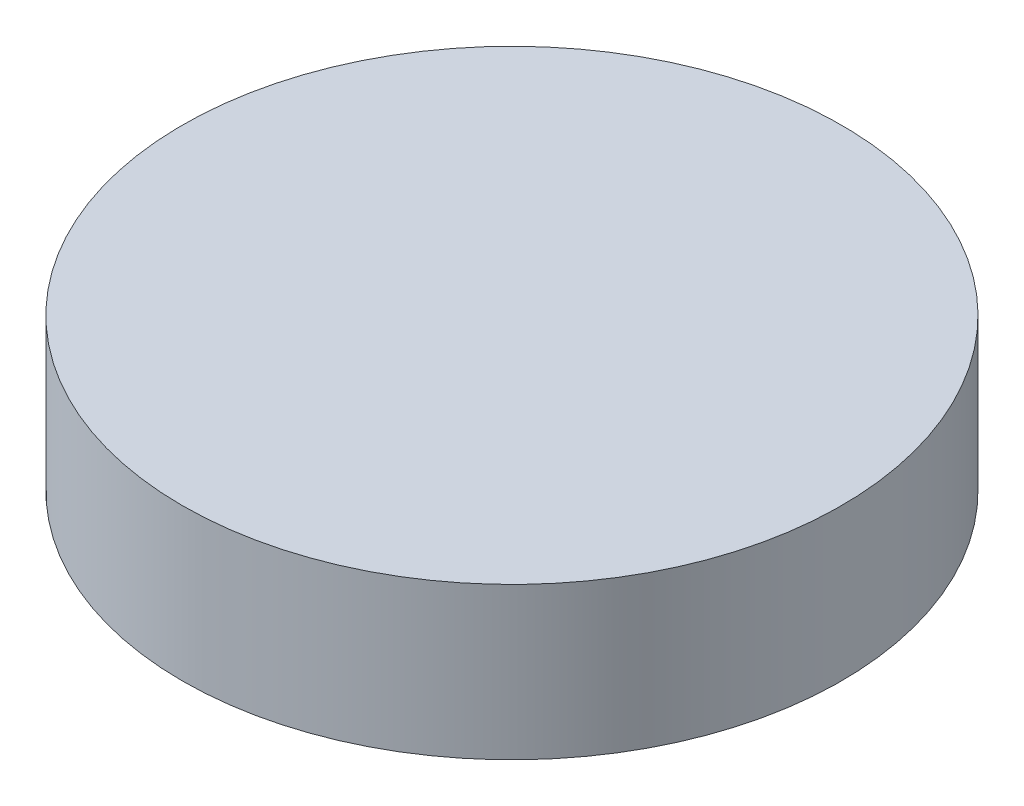
ISO-10303-21;
HEADER;
FILE_DESCRIPTION(('STEP AP214'),'2;1');
FILE_NAME('part.step','',(''),(''),'','','');
FILE_SCHEMA(('AUTOMOTIVE_DESIGN { 1 0 10303 214 1 1 1 1 }'));
ENDSEC;
DATA;
#1=APPLICATION_CONTEXT('core data for automotive mechanical design processes');
#2=APPLICATION_PROTOCOL_DEFINITION('international standard','automotive_design',2000,#1);
#3=PRODUCT_CONTEXT('',#1,'mechanical');
#4=PRODUCT('Part','Part','',(#3));
#5=PRODUCT_RELATED_PRODUCT_CATEGORY('part','',(#4));
#6=PRODUCT_DEFINITION_FORMATION('','',#4);
#7=PRODUCT_DEFINITION_CONTEXT('part definition',#1,'design');
#8=PRODUCT_DEFINITION('design','',#6,#7);
#9=PRODUCT_DEFINITION_SHAPE('','',#8);
#10=(LENGTH_UNIT() NAMED_UNIT(*) SI_UNIT(.MILLI.,.METRE.));
#11=(NAMED_UNIT(*) PLANE_ANGLE_UNIT() SI_UNIT($,.RADIAN.));
#12=(NAMED_UNIT(*) SI_UNIT($,.STERADIAN.) SOLID_ANGLE_UNIT());
#13=UNCERTAINTY_MEASURE_WITH_UNIT(LENGTH_MEASURE(1.E-05),#10,'distance_accuracy_value','');
#14=(GEOMETRIC_REPRESENTATION_CONTEXT(3) GLOBAL_UNCERTAINTY_ASSIGNED_CONTEXT((#13)) GLOBAL_UNIT_ASSIGNED_CONTEXT((#10,
#11,#12)) REPRESENTATION_CONTEXT('',''));
#15=CARTESIAN_POINT('',(0.,0.,0.));
#16=DIRECTION('',(0.,0.,1.));
#17=DIRECTION('',(1.,0.,0.));
#18=AXIS2_PLACEMENT_3D('',#15,#16,#17);
#19=CARTESIAN_POINT('',(-27.5,34.6557828482519,-11.5));
#20=DIRECTION('',(0.,1.,0.));
#21=DIRECTION('',(0.,0.,1.));
#22=AXIS2_PLACEMENT_3D('',#19,#20,#21);
#23=CYLINDRICAL_SURFACE('',#22,5.425);
#24=CARTESIAN_POINT('',(-27.5,50.5,-11.5));
#25=DIRECTION('',(0.,1.,0.));
#26=DIRECTION('',(0.,0.,1.));
#27=AXIS2_PLACEMENT_3D('',#24,#25,#26);
#28=CIRCLE('',#27,5.425);
#29=CARTESIAN_POINT('',(-27.5,50.5,-6.07499999999999));
#30=VERTEX_POINT('',#29);
#31=EDGE_CURVE('E11',#30,#30,#28,.F.);
#32=ORIENTED_EDGE('',*,*,#31,.F.);
#33=EDGE_LOOP('',(#32));
#34=FACE_BOUND('',#33,.T.);
#35=CARTESIAN_POINT('',(-27.5,53.,-11.5));
#36=DIRECTION('',(0.,1.,0.));
#37=DIRECTION('',(0.,0.,1.));
#38=AXIS2_PLACEMENT_3D('',#35,#36,#37);
#39=CIRCLE('',#38,5.425);
#40=CARTESIAN_POINT('',(-27.5,53.,-6.07499999999999));
#41=VERTEX_POINT('',#40);
#42=EDGE_CURVE('E43',#41,#41,#39,.T.);
#43=ORIENTED_EDGE('',*,*,#42,.F.);
#44=EDGE_LOOP('',(#43));
#45=FACE_BOUND('',#44,.T.);
#46=ADVANCED_FACE('F36',(#34,#45),#23,.T.);
#47=CARTESIAN_POINT('',(-27.5,53.,-11.5));
#48=DIRECTION('',(0.,1.,0.));
#49=DIRECTION('',(0.,0.,1.));
#50=AXIS2_PLACEMENT_3D('',#47,#48,#49);
#51=PLANE('',#50);
#52=ORIENTED_EDGE('',*,*,#42,.T.);
#53=EDGE_LOOP('',(#52));
#54=FACE_BOUND('',#53,.T.);
#55=ADVANCED_FACE('F50',(#54),#51,.T.);
#56=CARTESIAN_POINT('',(-27.25,50.5,-21.));
#57=DIRECTION('',(0.,1.,0.));
#58=DIRECTION('',(0.,0.,1.));
#59=AXIS2_PLACEMENT_3D('',#56,#57,#58);
#60=PLANE('',#59);
#61=ORIENTED_EDGE('',*,*,#31,.T.);
#62=EDGE_LOOP('',(#61));
#63=FACE_BOUND('',#62,.T.);
#64=ADVANCED_FACE('F57',(#63),#60,.F.);
#65=CLOSED_SHELL('',(#46,#55,#64));
#66=MANIFOLD_SOLID_BREP('B2',#65);
#67=ADVANCED_BREP_SHAPE_REPRESENTATION('',(#18,#66),#14);
#68=SHAPE_DEFINITION_REPRESENTATION(#9,#67);
ENDSEC;
END-ISO-10303-21;
